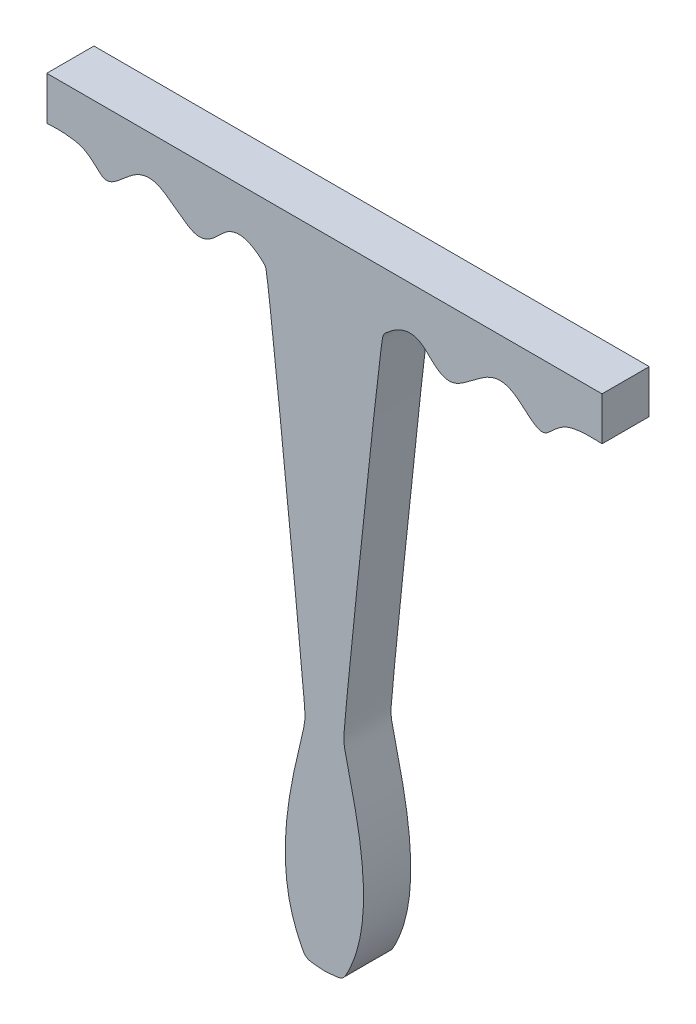
ISO-10303-21;
HEADER;
FILE_DESCRIPTION(('STEP AP214'),'2;1');
FILE_NAME('part.step','',(''),(''),'','','');
FILE_SCHEMA(('AUTOMOTIVE_DESIGN { 1 0 10303 214 1 1 1 1 }'));
ENDSEC;
DATA;
#1=APPLICATION_CONTEXT('core data for automotive mechanical design processes');
#2=APPLICATION_PROTOCOL_DEFINITION('international standard','automotive_design',2000,#1);
#3=PRODUCT_CONTEXT('',#1,'mechanical');
#4=PRODUCT('Part','Part','',(#3));
#5=PRODUCT_RELATED_PRODUCT_CATEGORY('part','',(#4));
#6=PRODUCT_DEFINITION_FORMATION('','',#4);
#7=PRODUCT_DEFINITION_CONTEXT('part definition',#1,'design');
#8=PRODUCT_DEFINITION('design','',#6,#7);
#9=PRODUCT_DEFINITION_SHAPE('','',#8);
#10=(LENGTH_UNIT() NAMED_UNIT(*) SI_UNIT(.MILLI.,.METRE.));
#11=(NAMED_UNIT(*) PLANE_ANGLE_UNIT() SI_UNIT($,.RADIAN.));
#12=(NAMED_UNIT(*) SI_UNIT($,.STERADIAN.) SOLID_ANGLE_UNIT());
#13=UNCERTAINTY_MEASURE_WITH_UNIT(LENGTH_MEASURE(1.E-05),#10,'distance_accuracy_value','');
#14=(GEOMETRIC_REPRESENTATION_CONTEXT(3) GLOBAL_UNCERTAINTY_ASSIGNED_CONTEXT((#13)) GLOBAL_UNIT_ASSIGNED_CONTEXT((#10,
#11,#12)) REPRESENTATION_CONTEXT('',''));
#15=CARTESIAN_POINT('',(0.,0.,0.));
#16=DIRECTION('',(0.,0.,1.));
#17=DIRECTION('',(1.,0.,0.));
#18=AXIS2_PLACEMENT_3D('',#15,#16,#17);
#19=CARTESIAN_POINT('',(-50.,24.2025449644818,8.5));
#20=DIRECTION('',(1.,0.,0.));
#21=DIRECTION('',(0.,0.,-1.));
#22=AXIS2_PLACEMENT_3D('',#19,#20,#21);
#23=PLANE('',#22);
#24=DIRECTION('',(0.,-1.,0.));
#25=VECTOR('',#24,1.);
#26=CARTESIAN_POINT('',(-50.,24.2025449644818,0.));
#27=LINE('',#26,#25);
#28=CARTESIAN_POINT('',(-50.,24.2025449644818,0.));
#29=VERTEX_POINT('',#28);
#30=CARTESIAN_POINT('',(-50.,16.4025449644818,0.));
#31=VERTEX_POINT('',#30);
#32=EDGE_CURVE('E112',#29,#31,#27,.T.);
#33=ORIENTED_EDGE('',*,*,#32,.T.);
#34=DIRECTION('',(0.,0.,-1.));
#35=VECTOR('',#34,1.);
#36=CARTESIAN_POINT('',(-50.,16.4025449644818,8.5));
#37=LINE('',#36,#35);
#38=CARTESIAN_POINT('',(-50.,16.4025449644818,8.5));
#39=VERTEX_POINT('',#38);
#40=EDGE_CURVE('E11',#39,#31,#37,.T.);
#41=ORIENTED_EDGE('',*,*,#40,.F.);
#42=DIRECTION('',(0.,-1.,0.));
#43=VECTOR('',#42,1.);
#44=CARTESIAN_POINT('',(-50.,24.2025449644818,8.5));
#45=LINE('',#44,#43);
#46=CARTESIAN_POINT('',(-50.,24.2025449644818,8.5));
#47=VERTEX_POINT('',#46);
#48=EDGE_CURVE('E130',#47,#39,#45,.T.);
#49=ORIENTED_EDGE('',*,*,#48,.F.);
#50=DIRECTION('',(0.,0.,-1.));
#51=VECTOR('',#50,1.);
#52=CARTESIAN_POINT('',(-50.,24.2025449644818,8.5));
#53=LINE('',#52,#51);
#54=EDGE_CURVE('E105',#47,#29,#53,.T.);
#55=ORIENTED_EDGE('',*,*,#54,.T.);
#56=EDGE_LOOP('',(#33,#41,#49,#55));
#57=FACE_BOUND('',#56,.T.);
#58=ADVANCED_FACE('F35',(#57),#23,.F.);
#59=CARTESIAN_POINT('',(-50.,16.4025449644818,8.5));
#60=CARTESIAN_POINT('',(-49.8421408843161,16.3860561109094,8.5));
#61=CARTESIAN_POINT('',(-42.4037891043383,17.1357755837029,8.5));
#62=CARTESIAN_POINT('',(-39.6186862799911,10.7860907711775,8.5));
#63=CARTESIAN_POINT('',(-33.93488141527,17.4990503412664,8.5));
#64=CARTESIAN_POINT('',(-30.5564445577005,17.2857315817429,8.5));
#65=CARTESIAN_POINT('',(-26.8962567975081,14.9522059881065,8.5));
#66=CARTESIAN_POINT('',(-21.7767940729047,10.2493960888554,8.5));
#67=CARTESIAN_POINT('',(-16.6861003194177,18.7923965252932,8.5));
#68=CARTESIAN_POINT('',(-10.7282538197974,14.0803056309774,8.5));
#69=CARTESIAN_POINT('',(-10.0954028850687,12.8318047553528,8.5));
#70=CARTESIAN_POINT('',(-3.56697307700779,-49.8091263906122,8.5));
#71=CARTESIAN_POINT('',(-3.32808402868578,-55.5257699261003,8.5));
#72=CARTESIAN_POINT('',(-9.9955668499668,-75.8742025508505,8.5));
#73=CARTESIAN_POINT('',(-3.49644173709855,-90.6478194768333,8.5));
#74=CARTESIAN_POINT('',(-2.93231047115833,-90.5969815820841,8.5));
#75=CARTESIAN_POINT('',(3.12166720155264E-13,-90.7974550355182,8.5));
#76=B_SPLINE_CURVE_WITH_KNOTS('',3,(#59,#60,#61,#62,#63,#64,#65,#66,#67,#68,#69,#70,#71,#72,#73,
#74,#75),.UNSPECIFIED.,.F.,.F.,(4,1,1,1,1,1,1,1,1,1,1,1,1,1,4),(0.,0.0174269321608963,
0.0343133364382755,0.0517650277080296,0.0727694773795201,0.0777429354107975,0.101499608020803,
0.145976931474065,0.215723623578933,0.261466106268995,0.565408908140719,0.636790674735576,
0.903902005622716,0.943561829785248,1.),.UNSPECIFIED.);
#77=DIRECTION('',(0.,0.,-1.));
#78=VECTOR('',#77,1.);
#79=SURFACE_OF_LINEAR_EXTRUSION('',#76,#78);
#80=CARTESIAN_POINT('',(-50.,16.4025449644818,0.));
#81=CARTESIAN_POINT('',(-49.8421408843161,16.3860561109094,0.));
#82=CARTESIAN_POINT('',(-42.4037891043383,17.1357755837029,0.));
#83=CARTESIAN_POINT('',(-39.6186862799911,10.7860907711775,0.));
#84=CARTESIAN_POINT('',(-33.93488141527,17.4990503412664,0.));
#85=CARTESIAN_POINT('',(-30.5564445577005,17.2857315817429,0.));
#86=CARTESIAN_POINT('',(-26.8962567975081,14.9522059881065,0.));
#87=CARTESIAN_POINT('',(-21.7767940729047,10.2493960888554,0.));
#88=CARTESIAN_POINT('',(-16.6861003194177,18.7923965252932,0.));
#89=CARTESIAN_POINT('',(-10.7282538197974,14.0803056309774,0.));
#90=CARTESIAN_POINT('',(-10.0954028850687,12.8318047553528,0.));
#91=CARTESIAN_POINT('',(-3.56697307700779,-49.8091263906122,0.));
#92=CARTESIAN_POINT('',(-3.32808402868578,-55.5257699261003,0.));
#93=CARTESIAN_POINT('',(-9.9955668499668,-75.8742025508505,0.));
#94=CARTESIAN_POINT('',(-3.49644173709855,-90.6478194768333,0.));
#95=CARTESIAN_POINT('',(-2.93231047115833,-90.5969815820841,0.));
#96=CARTESIAN_POINT('',(3.12166720155264E-13,-90.7974550355182,0.));
#97=B_SPLINE_CURVE_WITH_KNOTS('',3,(#80,#81,#82,#83,#84,#85,#86,#87,#88,#89,#90,#91,#92,#93,#94,
#95,#96),.UNSPECIFIED.,.F.,.F.,(4,1,1,1,1,1,1,1,1,1,1,1,1,1,4),(0.,0.0174269321608963,
0.0343133364382755,0.0517650277080296,0.0727694773795201,0.0777429354107975,0.101499608020803,
0.145976931474065,0.215723623578933,0.261466106268995,0.565408908140719,0.636790674735576,
0.903902005622716,0.943561829785248,1.),.UNSPECIFIED.);
#98=CARTESIAN_POINT('',(-3.12166720155264E-13,-90.7974550355182,0.));
#99=VERTEX_POINT('',#98);
#100=EDGE_CURVE('E115',#31,#99,#97,.T.);
#101=ORIENTED_EDGE('',*,*,#100,.T.);
#102=DIRECTION('',(0.,0.,-1.));
#103=VECTOR('',#102,1.);
#104=CARTESIAN_POINT('',(-3.12166720155264E-13,-90.7974550355182,8.5));
#105=LINE('',#104,#103);
#106=CARTESIAN_POINT('',(-3.12166720155264E-13,-90.7974550355182,8.5));
#107=VERTEX_POINT('',#106);
#108=EDGE_CURVE('E43',#107,#99,#105,.T.);
#109=ORIENTED_EDGE('',*,*,#108,.F.);
#110=EDGE_CURVE('E85',#39,#107,#76,.T.);
#111=ORIENTED_EDGE('',*,*,#110,.F.);
#112=ORIENTED_EDGE('',*,*,#40,.T.);
#113=EDGE_LOOP('',(#101,#109,#111,#112));
#114=FACE_BOUND('',#113,.T.);
#115=ADVANCED_FACE('F149',(#114),#79,.F.);
#116=CARTESIAN_POINT('',(-3.12166720155264E-13,-90.7974550355182,8.5));
#117=CARTESIAN_POINT('',(2.93231047115833,-90.5969815820841,8.5));
#118=CARTESIAN_POINT('',(3.49644173709855,-90.6478194768333,8.5));
#119=CARTESIAN_POINT('',(9.9955668499668,-75.8742025508505,8.5));
#120=CARTESIAN_POINT('',(3.32808402868578,-55.5257699261003,8.5));
#121=CARTESIAN_POINT('',(3.56697307700779,-49.8091263906122,8.5));
#122=CARTESIAN_POINT('',(10.0954028850687,12.8318047553528,8.5));
#123=CARTESIAN_POINT('',(10.7282538197974,14.0803056309774,8.5));
#124=CARTESIAN_POINT('',(16.6861003194177,18.7923965252932,8.5));
#125=CARTESIAN_POINT('',(21.7767940729047,10.2493960888554,8.5));
#126=CARTESIAN_POINT('',(26.8962567975081,14.9522059881065,8.5));
#127=CARTESIAN_POINT('',(30.5564445577005,17.2857315817429,8.5));
#128=CARTESIAN_POINT('',(33.93488141527,17.4990503412664,8.5));
#129=CARTESIAN_POINT('',(39.6186862799911,10.7860907711775,8.5));
#130=CARTESIAN_POINT('',(42.4037891043383,17.1357755837029,8.5));
#131=CARTESIAN_POINT('',(49.8421408843161,16.3860561109094,8.5));
#132=CARTESIAN_POINT('',(50.,16.4025449644818,8.5));
#133=B_SPLINE_CURVE_WITH_KNOTS('',3,(#116,#117,#118,#119,#120,#121,#122,#123,#124,#125,#126,
#127,#128,#129,#130,#131,#132),.UNSPECIFIED.,.F.,.F.,(4,1,1,1,1,1,1,1,1,1,1,1,1,1,4),(0.,
0.0564381702147523,0.0960979943772836,0.363209325264424,0.434591091859281,0.738533893731005,
0.784276376421067,0.854023068525935,0.898500391979197,0.922257064589203,0.92723052262048,
0.94823497229197,0.965686663561725,0.982573067839104,1.),.UNSPECIFIED.);
#134=DIRECTION('',(0.,0.,-1.));
#135=VECTOR('',#134,1.);
#136=SURFACE_OF_LINEAR_EXTRUSION('',#133,#135);
#137=CARTESIAN_POINT('',(-3.12166720155264E-13,-90.7974550355182,0.));
#138=CARTESIAN_POINT('',(2.93231047115833,-90.5969815820841,0.));
#139=CARTESIAN_POINT('',(3.49644173709855,-90.6478194768333,0.));
#140=CARTESIAN_POINT('',(9.9955668499668,-75.8742025508505,0.));
#141=CARTESIAN_POINT('',(3.32808402868578,-55.5257699261003,0.));
#142=CARTESIAN_POINT('',(3.56697307700779,-49.8091263906122,0.));
#143=CARTESIAN_POINT('',(10.0954028850687,12.8318047553528,0.));
#144=CARTESIAN_POINT('',(10.7282538197974,14.0803056309774,0.));
#145=CARTESIAN_POINT('',(16.6861003194177,18.7923965252932,0.));
#146=CARTESIAN_POINT('',(21.7767940729047,10.2493960888554,0.));
#147=CARTESIAN_POINT('',(26.8962567975081,14.9522059881065,0.));
#148=CARTESIAN_POINT('',(30.5564445577005,17.2857315817429,0.));
#149=CARTESIAN_POINT('',(33.93488141527,17.4990503412664,0.));
#150=CARTESIAN_POINT('',(39.6186862799911,10.7860907711775,0.));
#151=CARTESIAN_POINT('',(42.4037891043383,17.1357755837029,0.));
#152=CARTESIAN_POINT('',(49.8421408843161,16.3860561109094,0.));
#153=CARTESIAN_POINT('',(50.,16.4025449644818,0.));
#154=B_SPLINE_CURVE_WITH_KNOTS('',3,(#137,#138,#139,#140,#141,#142,#143,#144,#145,#146,#147,
#148,#149,#150,#151,#152,#153),.UNSPECIFIED.,.F.,.F.,(4,1,1,1,1,1,1,1,1,1,1,1,1,1,4),(0.,
0.0564381702147523,0.0960979943772836,0.363209325264424,0.434591091859281,0.738533893731005,
0.784276376421067,0.854023068525935,0.898500391979197,0.922257064589203,0.92723052262048,
0.94823497229197,0.965686663561725,0.982573067839104,1.),.UNSPECIFIED.);
#155=CARTESIAN_POINT('',(50.,16.4025449644818,0.));
#156=VERTEX_POINT('',#155);
#157=EDGE_CURVE('E100',#99,#156,#154,.T.);
#158=ORIENTED_EDGE('',*,*,#157,.T.);
#159=DIRECTION('',(0.,0.,-1.));
#160=VECTOR('',#159,1.);
#161=CARTESIAN_POINT('',(50.,16.4025449644818,8.5));
#162=LINE('',#161,#160);
#163=CARTESIAN_POINT('',(50.,16.4025449644818,8.5));
#164=VERTEX_POINT('',#163);
#165=EDGE_CURVE('E97',#164,#156,#162,.T.);
#166=ORIENTED_EDGE('',*,*,#165,.F.);
#167=EDGE_CURVE('E89',#107,#164,#133,.T.);
#168=ORIENTED_EDGE('',*,*,#167,.F.);
#169=ORIENTED_EDGE('',*,*,#108,.T.);
#170=EDGE_LOOP('',(#158,#166,#168,#169));
#171=FACE_BOUND('',#170,.T.);
#172=ADVANCED_FACE('F98',(#171),#136,.F.);
#173=CARTESIAN_POINT('',(50.,24.2025449644818,8.5));
#174=DIRECTION('',(-1.,0.,0.));
#175=DIRECTION('',(0.,0.,1.));
#176=AXIS2_PLACEMENT_3D('',#173,#174,#175);
#177=PLANE('',#176);
#178=DIRECTION('',(0.,1.,0.));
#179=VECTOR('',#178,1.);
#180=CARTESIAN_POINT('',(50.,24.2025449644818,0.));
#181=LINE('',#180,#179);
#182=CARTESIAN_POINT('',(50.,24.2025449644818,0.));
#183=VERTEX_POINT('',#182);
#184=EDGE_CURVE('E71',#156,#183,#181,.T.);
#185=ORIENTED_EDGE('',*,*,#184,.T.);
#186=DIRECTION('',(0.,0.,-1.));
#187=VECTOR('',#186,1.);
#188=CARTESIAN_POINT('',(50.,24.2025449644818,8.5));
#189=LINE('',#188,#187);
#190=CARTESIAN_POINT('',(50.,24.2025449644818,8.5));
#191=VERTEX_POINT('',#190);
#192=EDGE_CURVE('E101',#191,#183,#189,.T.);
#193=ORIENTED_EDGE('',*,*,#192,.F.);
#194=DIRECTION('',(0.,1.,0.));
#195=VECTOR('',#194,1.);
#196=CARTESIAN_POINT('',(50.,24.2025449644818,8.5));
#197=LINE('',#196,#195);
#198=EDGE_CURVE('E93',#164,#191,#197,.T.);
#199=ORIENTED_EDGE('',*,*,#198,.F.);
#200=ORIENTED_EDGE('',*,*,#165,.T.);
#201=EDGE_LOOP('',(#185,#193,#199,#200));
#202=FACE_BOUND('',#201,.T.);
#203=ADVANCED_FACE('F103',(#202),#177,.F.);
#204=CARTESIAN_POINT('',(50.,24.2025449644818,8.5));
#205=DIRECTION('',(0.,-1.,0.));
#206=DIRECTION('',(0.,0.,-1.));
#207=AXIS2_PLACEMENT_3D('',#204,#205,#206);
#208=PLANE('',#207);
#209=DIRECTION('',(-1.,0.,0.));
#210=VECTOR('',#209,1.);
#211=CARTESIAN_POINT('',(50.,24.2025449644818,0.));
#212=LINE('',#211,#210);
#213=EDGE_CURVE('E77',#183,#29,#212,.T.);
#214=ORIENTED_EDGE('',*,*,#213,.T.);
#215=ORIENTED_EDGE('',*,*,#54,.F.);
#216=DIRECTION('',(-1.,0.,0.));
#217=VECTOR('',#216,1.);
#218=CARTESIAN_POINT('',(50.,24.2025449644818,8.5));
#219=LINE('',#218,#217);
#220=EDGE_CURVE('E51',#191,#47,#219,.T.);
#221=ORIENTED_EDGE('',*,*,#220,.F.);
#222=ORIENTED_EDGE('',*,*,#192,.T.);
#223=EDGE_LOOP('',(#214,#215,#221,#222));
#224=FACE_BOUND('',#223,.T.);
#225=ADVANCED_FACE('F138',(#224),#208,.F.);
#226=CARTESIAN_POINT('',(-4.76716657056442,-38.9576169095289,8.5));
#227=DIRECTION('',(0.,0.,-1.));
#228=DIRECTION('',(-1.,0.,0.));
#229=AXIS2_PLACEMENT_3D('',#226,#227,#228);
#230=PLANE('',#229);
#231=ORIENTED_EDGE('',*,*,#48,.T.);
#232=ORIENTED_EDGE('',*,*,#110,.T.);
#233=ORIENTED_EDGE('',*,*,#167,.T.);
#234=ORIENTED_EDGE('',*,*,#198,.T.);
#235=ORIENTED_EDGE('',*,*,#220,.T.);
#236=EDGE_LOOP('',(#231,#232,#233,#234,#235));
#237=FACE_BOUND('',#236,.T.);
#238=ADVANCED_FACE('F91',(#237),#230,.F.);
#239=CARTESIAN_POINT('',(-4.76716657056442,-38.9576169095289,0.));
#240=DIRECTION('',(0.,0.,-1.));
#241=DIRECTION('',(-1.,0.,0.));
#242=AXIS2_PLACEMENT_3D('',#239,#240,#241);
#243=PLANE('',#242);
#244=ORIENTED_EDGE('',*,*,#32,.F.);
#245=ORIENTED_EDGE('',*,*,#213,.F.);
#246=ORIENTED_EDGE('',*,*,#184,.F.);
#247=ORIENTED_EDGE('',*,*,#157,.F.);
#248=ORIENTED_EDGE('',*,*,#100,.F.);
#249=EDGE_LOOP('',(#244,#245,#246,#247,#248));
#250=FACE_BOUND('',#249,.T.);
#251=ADVANCED_FACE('F134',(#250),#243,.T.);
#252=CLOSED_SHELL('',(#58,#115,#172,#203,#225,#238,#251));
#253=MANIFOLD_SOLID_BREP('B2',#252);
#254=ADVANCED_BREP_SHAPE_REPRESENTATION('',(#18,#253),#14);
#255=SHAPE_DEFINITION_REPRESENTATION(#9,#254);
ENDSEC;
END-ISO-10303-21;
